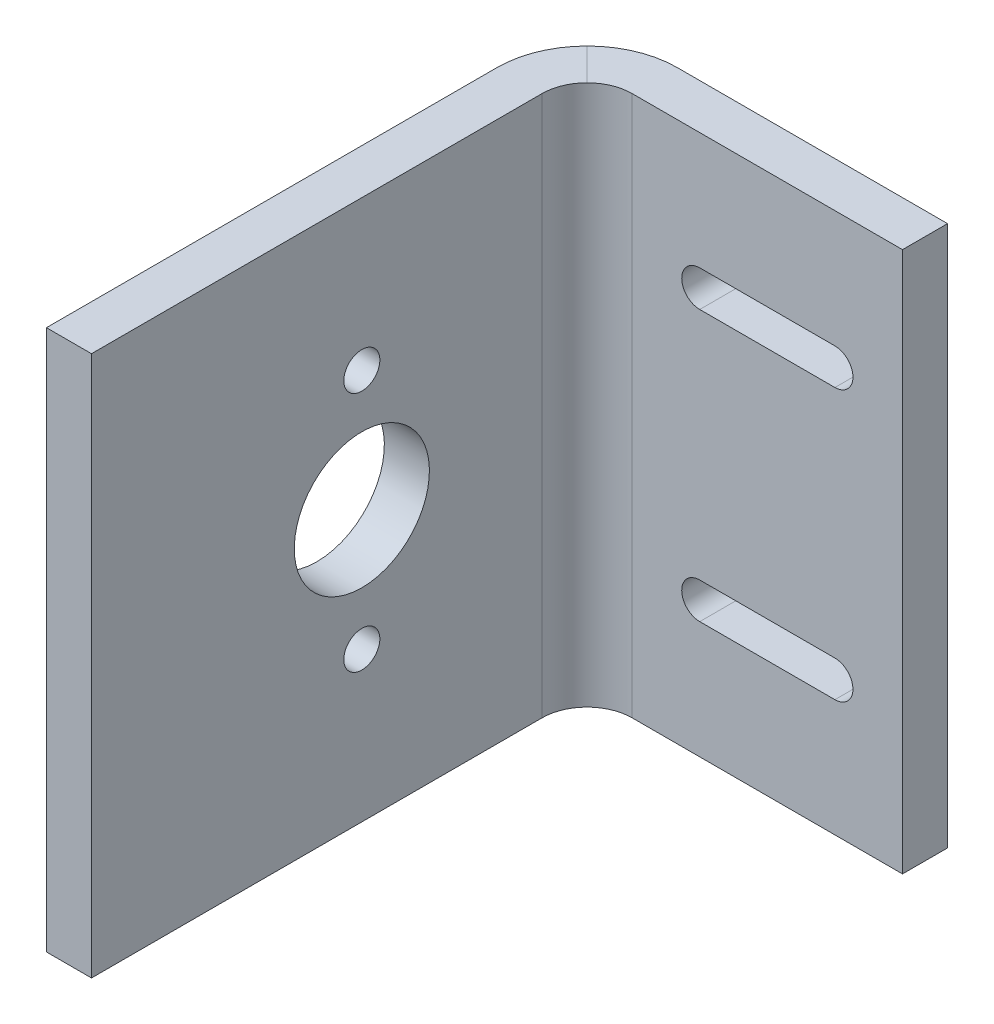
ISO-10303-21;
HEADER;
FILE_DESCRIPTION(('STEP AP214'),'2;1');
FILE_NAME('part.step','',(''),(''),'','','');
FILE_SCHEMA(('AUTOMOTIVE_DESIGN { 1 0 10303 214 1 1 1 1 }'));
ENDSEC;
DATA;
#1=APPLICATION_CONTEXT('core data for automotive mechanical design processes');
#2=APPLICATION_PROTOCOL_DEFINITION('international standard','automotive_design',2000,#1);
#3=PRODUCT_CONTEXT('',#1,'mechanical');
#4=PRODUCT('Part','Part','',(#3));
#5=PRODUCT_RELATED_PRODUCT_CATEGORY('part','',(#4));
#6=PRODUCT_DEFINITION_FORMATION('','',#4);
#7=PRODUCT_DEFINITION_CONTEXT('part definition',#1,'design');
#8=PRODUCT_DEFINITION('design','',#6,#7);
#9=PRODUCT_DEFINITION_SHAPE('','',#8);
#10=(LENGTH_UNIT() NAMED_UNIT(*) SI_UNIT(.MILLI.,.METRE.));
#11=(NAMED_UNIT(*) PLANE_ANGLE_UNIT() SI_UNIT($,.RADIAN.));
#12=(NAMED_UNIT(*) SI_UNIT($,.STERADIAN.) SOLID_ANGLE_UNIT());
#13=UNCERTAINTY_MEASURE_WITH_UNIT(LENGTH_MEASURE(1.E-05),#10,'distance_accuracy_value','');
#14=(GEOMETRIC_REPRESENTATION_CONTEXT(3) GLOBAL_UNCERTAINTY_ASSIGNED_CONTEXT((#13)) GLOBAL_UNIT_ASSIGNED_CONTEXT((#10,
#11,#12)) REPRESENTATION_CONTEXT('',''));
#15=CARTESIAN_POINT('',(0.,0.,0.));
#16=DIRECTION('',(0.,0.,1.));
#17=DIRECTION('',(1.,0.,0.));
#18=AXIS2_PLACEMENT_3D('',#15,#16,#17);
#19=CARTESIAN_POINT('',(25.4,0.,-38.1));
#20=DIRECTION('',(-1.,0.,0.));
#21=DIRECTION('',(0.,0.,1.));
#22=AXIS2_PLACEMENT_3D('',#19,#20,#21);
#23=PLANE('',#22);
#24=DIRECTION('',(0.,1.,0.));
#25=VECTOR('',#24,1.);
#26=CARTESIAN_POINT('',(25.4,-19.05,-34.925));
#27=LINE('',#26,#25);
#28=CARTESIAN_POINT('',(25.4,-19.05,-34.925));
#29=VERTEX_POINT('',#28);
#30=CARTESIAN_POINT('',(25.4,19.05,-34.925));
#31=VERTEX_POINT('',#30);
#32=EDGE_CURVE('E284',#29,#31,#27,.T.);
#33=ORIENTED_EDGE('',*,*,#32,.F.);
#34=DIRECTION('',(0.,0.,1.));
#35=VECTOR('',#34,1.);
#36=CARTESIAN_POINT('',(25.4,-19.05,-34.925));
#37=LINE('',#36,#35);
#38=CARTESIAN_POINT('',(25.4,-19.05,-38.1));
#39=VERTEX_POINT('',#38);
#40=EDGE_CURVE('E270',#39,#29,#37,.T.);
#41=ORIENTED_EDGE('',*,*,#40,.F.);
#42=DIRECTION('',(0.,-1.,0.));
#43=VECTOR('',#42,1.);
#44=CARTESIAN_POINT('',(25.4,-19.05,-38.1));
#45=LINE('',#44,#43);
#46=CARTESIAN_POINT('',(25.4,19.05,-38.1));
#47=VERTEX_POINT('',#46);
#48=EDGE_CURVE('E275',#47,#39,#45,.T.);
#49=ORIENTED_EDGE('',*,*,#48,.F.);
#50=DIRECTION('',(0.,0.,-1.));
#51=VECTOR('',#50,1.);
#52=CARTESIAN_POINT('',(25.4,19.05,-34.925));
#53=LINE('',#52,#51);
#54=EDGE_CURVE('E280',#31,#47,#53,.T.);
#55=ORIENTED_EDGE('',*,*,#54,.F.);
#56=EDGE_LOOP('',(#33,#41,#49,#55));
#57=FACE_BOUND('',#56,.T.);
#58=ADVANCED_FACE('F33',(#57),#23,.F.);
#59=CARTESIAN_POINT('',(0.,0.,0.));
#60=DIRECTION('',(0.,0.,1.));
#61=DIRECTION('',(1.,0.,0.));
#62=AXIS2_PLACEMENT_3D('',#59,#60,#61);
#63=PLANE('',#62);
#64=DIRECTION('',(0.,1.,0.));
#65=VECTOR('',#64,1.);
#66=CARTESIAN_POINT('',(3.175,-19.05,0.));
#67=LINE('',#66,#65);
#68=CARTESIAN_POINT('',(3.175,-19.05,0.));
#69=VERTEX_POINT('',#68);
#70=CARTESIAN_POINT('',(3.17499999999999,19.05,0.));
#71=VERTEX_POINT('',#70);
#72=EDGE_CURVE('E257',#69,#71,#67,.T.);
#73=ORIENTED_EDGE('',*,*,#72,.T.);
#74=DIRECTION('',(-1.,0.,0.));
#75=VECTOR('',#74,1.);
#76=CARTESIAN_POINT('',(3.17499999999999,19.05,0.));
#77=LINE('',#76,#75);
#78=CARTESIAN_POINT('',(0.,19.05,0.));
#79=VERTEX_POINT('',#78);
#80=EDGE_CURVE('E251',#71,#79,#77,.T.);
#81=ORIENTED_EDGE('',*,*,#80,.T.);
#82=DIRECTION('',(0.,-1.,0.));
#83=VECTOR('',#82,1.);
#84=CARTESIAN_POINT('',(0.,-19.05,0.));
#85=LINE('',#84,#83);
#86=CARTESIAN_POINT('',(0.,-19.05,0.));
#87=VERTEX_POINT('',#86);
#88=EDGE_CURVE('E242',#79,#87,#85,.T.);
#89=ORIENTED_EDGE('',*,*,#88,.T.);
#90=DIRECTION('',(1.,0.,0.));
#91=VECTOR('',#90,1.);
#92=CARTESIAN_POINT('',(3.175,-19.05,0.));
#93=LINE('',#92,#91);
#94=EDGE_CURVE('E239',#87,#69,#93,.T.);
#95=ORIENTED_EDGE('',*,*,#94,.T.);
#96=EDGE_LOOP('',(#73,#81,#89,#95));
#97=FACE_BOUND('',#96,.T.);
#98=ADVANCED_FACE('F361',(#97),#63,.T.);
#99=CARTESIAN_POINT('',(0.,-19.05,-34.925));
#100=DIRECTION('',(0.,0.,-1.));
#101=DIRECTION('',(0.,1.,0.));
#102=AXIS2_PLACEMENT_3D('',#99,#100,#101);
#103=PLANE('',#102);
#104=DIRECTION('',(1.,0.,0.));
#105=VECTOR('',#104,1.);
#106=CARTESIAN_POINT('',(0.,-8.25500000000001,-34.925));
#107=LINE('',#106,#105);
#108=CARTESIAN_POINT('',(11.1125,-8.25500000000001,-34.925));
#109=VERTEX_POINT('',#108);
#110=CARTESIAN_POINT('',(20.6375,-8.25500000000001,-34.925));
#111=VERTEX_POINT('',#110);
#112=EDGE_CURVE('E223',#109,#111,#107,.T.);
#113=ORIENTED_EDGE('',*,*,#112,.T.);
#114=CARTESIAN_POINT('',(20.6375,-9.52500000000001,-34.925));
#115=DIRECTION('',(0.,0.,-1.));
#116=DIRECTION('',(0.,1.,0.));
#117=AXIS2_PLACEMENT_3D('',#114,#115,#116);
#118=CIRCLE('',#117,1.27);
#119=CARTESIAN_POINT('',(20.6375,-10.795,-34.925));
#120=VERTEX_POINT('',#119);
#121=EDGE_CURVE('E226',#111,#120,#118,.T.);
#122=ORIENTED_EDGE('',*,*,#121,.T.);
#123=DIRECTION('',(-1.,0.,0.));
#124=VECTOR('',#123,1.);
#125=CARTESIAN_POINT('',(0.,-10.795,-34.925));
#126=LINE('',#125,#124);
#127=CARTESIAN_POINT('',(11.1125,-10.795,-34.925));
#128=VERTEX_POINT('',#127);
#129=EDGE_CURVE('E220',#120,#128,#126,.T.);
#130=ORIENTED_EDGE('',*,*,#129,.T.);
#131=CARTESIAN_POINT('',(11.1125,-9.52500000000001,-34.925));
#132=DIRECTION('',(0.,0.,-1.));
#133=DIRECTION('',(0.,1.,0.));
#134=AXIS2_PLACEMENT_3D('',#131,#132,#133);
#135=CIRCLE('',#134,1.27);
#136=EDGE_CURVE('E164',#128,#109,#135,.T.);
#137=ORIENTED_EDGE('',*,*,#136,.T.);
#138=EDGE_LOOP('',(#113,#122,#130,#137));
#139=FACE_BOUND('',#138,.T.);
#140=DIRECTION('',(1.,0.,0.));
#141=VECTOR('',#140,1.);
#142=CARTESIAN_POINT('',(0.,10.795,-34.925));
#143=LINE('',#142,#141);
#144=CARTESIAN_POINT('',(11.1125,10.795,-34.925));
#145=VERTEX_POINT('',#144);
#146=CARTESIAN_POINT('',(20.6375,10.795,-34.925));
#147=VERTEX_POINT('',#146);
#148=EDGE_CURVE('E214',#145,#147,#143,.T.);
#149=ORIENTED_EDGE('',*,*,#148,.T.);
#150=CARTESIAN_POINT('',(20.6375,9.52500000000002,-34.925));
#151=DIRECTION('',(0.,0.,-1.));
#152=DIRECTION('',(0.,1.,0.));
#153=AXIS2_PLACEMENT_3D('',#150,#151,#152);
#154=CIRCLE('',#153,1.27);
#155=CARTESIAN_POINT('',(20.6375,8.25500000000002,-34.925));
#156=VERTEX_POINT('',#155);
#157=EDGE_CURVE('E217',#147,#156,#154,.T.);
#158=ORIENTED_EDGE('',*,*,#157,.T.);
#159=DIRECTION('',(-1.,0.,0.));
#160=VECTOR('',#159,1.);
#161=CARTESIAN_POINT('',(0.,8.25500000000002,-34.925));
#162=LINE('',#161,#160);
#163=CARTESIAN_POINT('',(11.1125,8.25500000000002,-34.925));
#164=VERTEX_POINT('',#163);
#165=EDGE_CURVE('E188',#156,#164,#162,.T.);
#166=ORIENTED_EDGE('',*,*,#165,.T.);
#167=CARTESIAN_POINT('',(11.1125,9.52500000000002,-34.925));
#168=DIRECTION('',(0.,0.,-1.));
#169=DIRECTION('',(0.,1.,0.));
#170=AXIS2_PLACEMENT_3D('',#167,#168,#169);
#171=CIRCLE('',#170,1.27);
#172=EDGE_CURVE('E211',#164,#145,#171,.T.);
#173=ORIENTED_EDGE('',*,*,#172,.T.);
#174=EDGE_LOOP('',(#149,#158,#166,#173));
#175=FACE_BOUND('',#174,.T.);
#176=DIRECTION('',(1.,0.,0.));
#177=VECTOR('',#176,1.);
#178=CARTESIAN_POINT('',(0.,19.05,-34.925));
#179=LINE('',#178,#177);
#180=CARTESIAN_POINT('',(6.35,19.05,-34.925));
#181=VERTEX_POINT('',#180);
#182=EDGE_CURVE('E283',#181,#31,#179,.T.);
#183=ORIENTED_EDGE('',*,*,#182,.F.);
#184=DIRECTION('',(0.,-1.,0.));
#185=VECTOR('',#184,1.);
#186=CARTESIAN_POINT('',(6.35,-19.05,-34.925));
#187=LINE('',#186,#185);
#188=CARTESIAN_POINT('',(6.35,-19.05,-34.925));
#189=VERTEX_POINT('',#188);
#190=EDGE_CURVE('E260',#181,#189,#187,.T.);
#191=ORIENTED_EDGE('',*,*,#190,.T.);
#192=DIRECTION('',(1.,0.,0.));
#193=VECTOR('',#192,1.);
#194=CARTESIAN_POINT('',(0.,-19.05,-34.925));
#195=LINE('',#194,#193);
#196=EDGE_CURVE('E265',#189,#29,#195,.T.);
#197=ORIENTED_EDGE('',*,*,#196,.T.);
#198=ORIENTED_EDGE('',*,*,#32,.T.);
#199=EDGE_LOOP('',(#183,#191,#197,#198));
#200=FACE_BOUND('',#199,.T.);
#201=ADVANCED_FACE('F358',(#139,#175,#200),#103,.F.);
#202=CARTESIAN_POINT('',(0.,19.05,-34.925));
#203=DIRECTION('',(0.,-1.,0.));
#204=DIRECTION('',(0.,0.,-1.));
#205=AXIS2_PLACEMENT_3D('',#202,#203,#204);
#206=PLANE('',#205);
#207=DIRECTION('',(1.,0.,0.));
#208=VECTOR('',#207,1.);
#209=CARTESIAN_POINT('',(0.,19.05,-38.1));
#210=LINE('',#209,#208);
#211=CARTESIAN_POINT('',(6.34999999999999,19.05,-38.1));
#212=VERTEX_POINT('',#211);
#213=EDGE_CURVE('E278',#212,#47,#210,.T.);
#214=ORIENTED_EDGE('',*,*,#213,.F.);
#215=CARTESIAN_POINT('',(6.34999999999999,19.05,-31.75));
#216=DIRECTION('',(0.,-1.,0.));
#217=DIRECTION('',(0.,0.,-1.));
#218=AXIS2_PLACEMENT_3D('',#215,#216,#217);
#219=CIRCLE('',#218,6.35);
#220=CARTESIAN_POINT('',(1.85987193946542,19.05,-36.2401280605346));
#221=VERTEX_POINT('',#220);
#222=EDGE_CURVE('E42',#212,#221,#219,.F.);
#223=ORIENTED_EDGE('',*,*,#222,.T.);
#224=DIRECTION('',(0.707106781186548,0.,0.707106781186548));
#225=VECTOR('',#224,1.);
#226=CARTESIAN_POINT('',(20.6375,19.05,-17.4625));
#227=LINE('',#226,#225);
#228=CARTESIAN_POINT('',(4.10493596973271,19.05,-33.9950640302673));
#229=VERTEX_POINT('',#228);
#230=EDGE_CURVE('E248',#221,#229,#227,.T.);
#231=ORIENTED_EDGE('',*,*,#230,.T.);
#232=CARTESIAN_POINT('',(6.35,19.05,-31.75));
#233=DIRECTION('',(0.,-1.,0.));
#234=DIRECTION('',(0.,0.,-1.));
#235=AXIS2_PLACEMENT_3D('',#232,#233,#234);
#236=CIRCLE('',#235,3.175);
#237=EDGE_CURVE('E301',#229,#181,#236,.T.);
#238=ORIENTED_EDGE('',*,*,#237,.T.);
#239=ORIENTED_EDGE('',*,*,#182,.T.);
#240=ORIENTED_EDGE('',*,*,#54,.T.);
#241=EDGE_LOOP('',(#214,#223,#231,#238,#239,#240));
#242=FACE_BOUND('',#241,.T.);
#243=ADVANCED_FACE('F357',(#242),#206,.F.);
#244=CARTESIAN_POINT('',(0.,-19.05,-38.1));
#245=DIRECTION('',(0.,0.,1.));
#246=DIRECTION('',(0.,-1.,0.));
#247=AXIS2_PLACEMENT_3D('',#244,#245,#246);
#248=PLANE('',#247);
#249=DIRECTION('',(-1.,0.,0.));
#250=VECTOR('',#249,1.);
#251=CARTESIAN_POINT('',(20.6375,-10.795,-38.1));
#252=LINE('',#251,#250);
#253=CARTESIAN_POINT('',(20.6375,-10.795,-38.1));
#254=VERTEX_POINT('',#253);
#255=CARTESIAN_POINT('',(11.1125,-10.795,-38.1));
#256=VERTEX_POINT('',#255);
#257=EDGE_CURVE('E171',#254,#256,#252,.T.);
#258=ORIENTED_EDGE('',*,*,#257,.F.);
#259=CARTESIAN_POINT('',(20.6375,-9.52500000000001,-38.1));
#260=DIRECTION('',(0.,0.,-1.));
#261=DIRECTION('',(0.,1.,0.));
#262=AXIS2_PLACEMENT_3D('',#259,#260,#261);
#263=CIRCLE('',#262,1.27);
#264=CARTESIAN_POINT('',(20.6375,-8.25500000000001,-38.1));
#265=VERTEX_POINT('',#264);
#266=EDGE_CURVE('E176',#265,#254,#263,.T.);
#267=ORIENTED_EDGE('',*,*,#266,.F.);
#268=DIRECTION('',(1.,0.,0.));
#269=VECTOR('',#268,1.);
#270=CARTESIAN_POINT('',(20.6375,-8.25500000000001,-38.1));
#271=LINE('',#270,#269);
#272=CARTESIAN_POINT('',(11.1125,-8.25500000000001,-38.1));
#273=VERTEX_POINT('',#272);
#274=EDGE_CURVE('E181',#273,#265,#271,.T.);
#275=ORIENTED_EDGE('',*,*,#274,.F.);
#276=CARTESIAN_POINT('',(11.1125,-9.52500000000001,-38.1));
#277=DIRECTION('',(0.,0.,-1.));
#278=DIRECTION('',(0.,1.,0.));
#279=AXIS2_PLACEMENT_3D('',#276,#277,#278);
#280=CIRCLE('',#279,1.27);
#281=EDGE_CURVE('E161',#256,#273,#280,.T.);
#282=ORIENTED_EDGE('',*,*,#281,.F.);
#283=EDGE_LOOP('',(#258,#267,#275,#282));
#284=FACE_BOUND('',#283,.T.);
#285=DIRECTION('',(-1.,0.,0.));
#286=VECTOR('',#285,1.);
#287=CARTESIAN_POINT('',(20.6375,8.25500000000002,-38.1));
#288=LINE('',#287,#286);
#289=CARTESIAN_POINT('',(20.6375,8.25500000000002,-38.1));
#290=VERTEX_POINT('',#289);
#291=CARTESIAN_POINT('',(11.1125,8.25500000000002,-38.1));
#292=VERTEX_POINT('',#291);
#293=EDGE_CURVE('E193',#290,#292,#288,.T.);
#294=ORIENTED_EDGE('',*,*,#293,.F.);
#295=CARTESIAN_POINT('',(20.6375,9.52500000000002,-38.1));
#296=DIRECTION('',(0.,0.,-1.));
#297=DIRECTION('',(0.,-1.,0.));
#298=AXIS2_PLACEMENT_3D('',#295,#296,#297);
#299=CIRCLE('',#298,1.27);
#300=CARTESIAN_POINT('',(20.6375,10.795,-38.1));
#301=VERTEX_POINT('',#300);
#302=EDGE_CURVE('E191',#301,#290,#299,.T.);
#303=ORIENTED_EDGE('',*,*,#302,.F.);
#304=DIRECTION('',(1.,0.,0.));
#305=VECTOR('',#304,1.);
#306=CARTESIAN_POINT('',(20.6375,10.795,-38.1));
#307=LINE('',#306,#305);
#308=CARTESIAN_POINT('',(11.1125,10.795,-38.1));
#309=VERTEX_POINT('',#308);
#310=EDGE_CURVE('E198',#309,#301,#307,.T.);
#311=ORIENTED_EDGE('',*,*,#310,.F.);
#312=CARTESIAN_POINT('',(11.1125,9.52500000000002,-38.1));
#313=DIRECTION('',(0.,0.,-1.));
#314=DIRECTION('',(0.,-1.,0.));
#315=AXIS2_PLACEMENT_3D('',#312,#313,#314);
#316=CIRCLE('',#315,1.27);
#317=EDGE_CURVE('E195',#292,#309,#316,.T.);
#318=ORIENTED_EDGE('',*,*,#317,.F.);
#319=EDGE_LOOP('',(#294,#303,#311,#318));
#320=FACE_BOUND('',#319,.T.);
#321=DIRECTION('',(1.,0.,0.));
#322=VECTOR('',#321,1.);
#323=CARTESIAN_POINT('',(0.,-19.05,-38.1));
#324=LINE('',#323,#322);
#325=CARTESIAN_POINT('',(6.35,-19.05,-38.1));
#326=VERTEX_POINT('',#325);
#327=EDGE_CURVE('E273',#326,#39,#324,.T.);
#328=ORIENTED_EDGE('',*,*,#327,.F.);
#329=DIRECTION('',(0.,-1.,0.));
#330=VECTOR('',#329,1.);
#331=CARTESIAN_POINT('',(6.35,-19.05,-38.1));
#332=LINE('',#331,#330);
#333=EDGE_CURVE('E310',#326,#212,#332,.F.);
#334=ORIENTED_EDGE('',*,*,#333,.T.);
#335=ORIENTED_EDGE('',*,*,#213,.T.);
#336=ORIENTED_EDGE('',*,*,#48,.T.);
#337=EDGE_LOOP('',(#328,#334,#335,#336));
#338=FACE_BOUND('',#337,.T.);
#339=ADVANCED_FACE('F178',(#284,#320,#338),#248,.F.);
#340=CARTESIAN_POINT('',(0.,-19.05,-34.925));
#341=DIRECTION('',(0.,1.,0.));
#342=DIRECTION('',(0.,0.,1.));
#343=AXIS2_PLACEMENT_3D('',#340,#341,#342);
#344=PLANE('',#343);
#345=DIRECTION('',(-0.707106781186548,0.,-0.707106781186548));
#346=VECTOR('',#345,1.);
#347=CARTESIAN_POINT('',(20.6375,-19.05,-17.4625));
#348=LINE('',#347,#346);
#349=CARTESIAN_POINT('',(4.10493596973271,-19.05,-33.9950640302673));
#350=VERTEX_POINT('',#349);
#351=CARTESIAN_POINT('',(1.85987193946542,-19.05,-36.2401280605346));
#352=VERTEX_POINT('',#351);
#353=EDGE_CURVE('E262',#350,#352,#348,.T.);
#354=ORIENTED_EDGE('',*,*,#353,.T.);
#355=CARTESIAN_POINT('',(6.35,-19.05,-31.75));
#356=DIRECTION('',(0.,1.,0.));
#357=DIRECTION('',(0.,0.,1.));
#358=AXIS2_PLACEMENT_3D('',#355,#356,#357);
#359=CIRCLE('',#358,6.35);
#360=EDGE_CURVE('E308',#352,#326,#359,.F.);
#361=ORIENTED_EDGE('',*,*,#360,.T.);
#362=ORIENTED_EDGE('',*,*,#327,.T.);
#363=ORIENTED_EDGE('',*,*,#40,.T.);
#364=ORIENTED_EDGE('',*,*,#196,.F.);
#365=CARTESIAN_POINT('',(6.35,-19.05,-31.75));
#366=DIRECTION('',(0.,1.,0.));
#367=DIRECTION('',(0.,0.,1.));
#368=AXIS2_PLACEMENT_3D('',#365,#366,#367);
#369=CIRCLE('',#368,3.175);
#370=EDGE_CURVE('E293',#189,#350,#369,.T.);
#371=ORIENTED_EDGE('',*,*,#370,.T.);
#372=EDGE_LOOP('',(#354,#361,#362,#363,#364,#371));
#373=FACE_BOUND('',#372,.T.);
#374=ADVANCED_FACE('F356',(#373),#344,.F.);
#375=CARTESIAN_POINT('',(0.,-19.05,0.));
#376=DIRECTION('',(1.,0.,0.));
#377=DIRECTION('',(0.,1.,0.));
#378=AXIS2_PLACEMENT_3D('',#375,#376,#377);
#379=PLANE('',#378);
#380=CARTESIAN_POINT('',(0.,8.509,-19.05));
#381=DIRECTION('',(-1.,0.,0.));
#382=DIRECTION('',(0.,-1.,0.));
#383=AXIS2_PLACEMENT_3D('',#380,#381,#382);
#384=CIRCLE('',#383,1.27);
#385=CARTESIAN_POINT('',(0.,7.239,-19.05));
#386=VERTEX_POINT('',#385);
#387=EDGE_CURVE('E230',#386,#386,#384,.T.);
#388=ORIENTED_EDGE('',*,*,#387,.F.);
#389=EDGE_LOOP('',(#388));
#390=FACE_BOUND('',#389,.T.);
#391=CARTESIAN_POINT('',(0.,-8.509,-19.05));
#392=DIRECTION('',(-1.,0.,0.));
#393=DIRECTION('',(0.,1.,0.));
#394=AXIS2_PLACEMENT_3D('',#391,#392,#393);
#395=CIRCLE('',#394,1.27);
#396=CARTESIAN_POINT('',(0.,-9.779,-19.05));
#397=VERTEX_POINT('',#396);
#398=EDGE_CURVE('E234',#397,#397,#395,.T.);
#399=ORIENTED_EDGE('',*,*,#398,.F.);
#400=EDGE_LOOP('',(#399));
#401=FACE_BOUND('',#400,.T.);
#402=CARTESIAN_POINT('',(0.,0.,-19.05));
#403=DIRECTION('',(-1.,0.,0.));
#404=DIRECTION('',(0.,-1.,0.));
#405=AXIS2_PLACEMENT_3D('',#402,#403,#404);
#406=CIRCLE('',#405,4.7625);
#407=CARTESIAN_POINT('',(0.,-4.7625,-19.05));
#408=VERTEX_POINT('',#407);
#409=EDGE_CURVE('E229',#408,#408,#406,.T.);
#410=ORIENTED_EDGE('',*,*,#409,.F.);
#411=EDGE_LOOP('',(#410));
#412=FACE_BOUND('',#411,.T.);
#413=DIRECTION('',(0.,0.,-1.));
#414=VECTOR('',#413,1.);
#415=CARTESIAN_POINT('',(0.,19.05,0.));
#416=LINE('',#415,#414);
#417=CARTESIAN_POINT('',(0.,19.05,-31.75));
#418=VERTEX_POINT('',#417);
#419=EDGE_CURVE('E247',#79,#418,#416,.T.);
#420=ORIENTED_EDGE('',*,*,#419,.T.);
#421=DIRECTION('',(0.,-1.,0.));
#422=VECTOR('',#421,1.);
#423=CARTESIAN_POINT('',(0.,-19.05,-31.75));
#424=LINE('',#423,#422);
#425=CARTESIAN_POINT('',(0.,-19.05,-31.75));
#426=VERTEX_POINT('',#425);
#427=EDGE_CURVE('E303',#418,#426,#424,.T.);
#428=ORIENTED_EDGE('',*,*,#427,.T.);
#429=DIRECTION('',(0.,0.,-1.));
#430=VECTOR('',#429,1.);
#431=CARTESIAN_POINT('',(0.,-19.05,0.));
#432=LINE('',#431,#430);
#433=EDGE_CURVE('E244',#87,#426,#432,.T.);
#434=ORIENTED_EDGE('',*,*,#433,.F.);
#435=ORIENTED_EDGE('',*,*,#88,.F.);
#436=EDGE_LOOP('',(#420,#428,#434,#435));
#437=FACE_BOUND('',#436,.T.);
#438=ADVANCED_FACE('F368',(#390,#401,#412,#437),#379,.F.);
#439=CARTESIAN_POINT('',(3.175,-19.05,0.));
#440=DIRECTION('',(-1.,0.,0.));
#441=DIRECTION('',(0.,-1.,0.));
#442=AXIS2_PLACEMENT_3D('',#439,#440,#441);
#443=PLANE('',#442);
#444=CARTESIAN_POINT('',(3.175,8.509,-19.05));
#445=DIRECTION('',(-1.,0.,0.));
#446=DIRECTION('',(0.,-1.,0.));
#447=AXIS2_PLACEMENT_3D('',#444,#445,#446);
#448=CIRCLE('',#447,1.27);
#449=CARTESIAN_POINT('',(3.175,7.239,-19.05));
#450=VERTEX_POINT('',#449);
#451=EDGE_CURVE('E37',#450,#450,#448,.T.);
#452=ORIENTED_EDGE('',*,*,#451,.T.);
#453=EDGE_LOOP('',(#452));
#454=FACE_BOUND('',#453,.T.);
#455=CARTESIAN_POINT('',(3.175,-8.509,-19.05));
#456=DIRECTION('',(-1.,0.,0.));
#457=DIRECTION('',(0.,-1.,0.));
#458=AXIS2_PLACEMENT_3D('',#455,#456,#457);
#459=CIRCLE('',#458,1.27);
#460=CARTESIAN_POINT('',(3.175,-9.779,-19.05));
#461=VERTEX_POINT('',#460);
#462=EDGE_CURVE('E314',#461,#461,#459,.T.);
#463=ORIENTED_EDGE('',*,*,#462,.T.);
#464=EDGE_LOOP('',(#463));
#465=FACE_BOUND('',#464,.T.);
#466=CARTESIAN_POINT('',(3.175,0.,-19.05));
#467=DIRECTION('',(-1.,0.,0.));
#468=DIRECTION('',(0.,-1.,0.));
#469=AXIS2_PLACEMENT_3D('',#466,#467,#468);
#470=CIRCLE('',#469,4.7625);
#471=CARTESIAN_POINT('',(3.175,-4.7625,-19.05));
#472=VERTEX_POINT('',#471);
#473=EDGE_CURVE('E233',#472,#472,#470,.T.);
#474=ORIENTED_EDGE('',*,*,#473,.T.);
#475=EDGE_LOOP('',(#474));
#476=FACE_BOUND('',#475,.T.);
#477=DIRECTION('',(0.,0.,-1.));
#478=VECTOR('',#477,1.);
#479=CARTESIAN_POINT('',(3.175,-19.05,0.));
#480=LINE('',#479,#478);
#481=CARTESIAN_POINT('',(3.175,-19.05,-31.75));
#482=VERTEX_POINT('',#481);
#483=EDGE_CURVE('E243',#69,#482,#480,.T.);
#484=ORIENTED_EDGE('',*,*,#483,.T.);
#485=DIRECTION('',(0.,-1.,0.));
#486=VECTOR('',#485,1.);
#487=CARTESIAN_POINT('',(3.17499999999999,19.05,-31.75));
#488=LINE('',#487,#486);
#489=CARTESIAN_POINT('',(3.17499999999999,19.05,-31.75));
#490=VERTEX_POINT('',#489);
#491=EDGE_CURVE('E291',#482,#490,#488,.F.);
#492=ORIENTED_EDGE('',*,*,#491,.T.);
#493=DIRECTION('',(0.,0.,-1.));
#494=VECTOR('',#493,1.);
#495=CARTESIAN_POINT('',(3.17499999999999,19.05,0.));
#496=LINE('',#495,#494);
#497=EDGE_CURVE('E254',#71,#490,#496,.T.);
#498=ORIENTED_EDGE('',*,*,#497,.F.);
#499=ORIENTED_EDGE('',*,*,#72,.F.);
#500=EDGE_LOOP('',(#484,#492,#498,#499));
#501=FACE_BOUND('',#500,.T.);
#502=ADVANCED_FACE('F321',(#454,#465,#476,#501),#443,.F.);
#503=CARTESIAN_POINT('',(3.17499999999999,19.05,0.));
#504=DIRECTION('',(0.,-1.,0.));
#505=DIRECTION('',(0.,0.,-1.));
#506=AXIS2_PLACEMENT_3D('',#503,#504,#505);
#507=PLANE('',#506);
#508=ORIENTED_EDGE('',*,*,#230,.F.);
#509=CARTESIAN_POINT('',(6.34999999999999,19.05,-31.75));
#510=DIRECTION('',(0.,-1.,0.));
#511=DIRECTION('',(0.,0.,-1.));
#512=AXIS2_PLACEMENT_3D('',#509,#510,#511);
#513=CIRCLE('',#512,6.35);
#514=EDGE_CURVE('E11',#221,#418,#513,.F.);
#515=ORIENTED_EDGE('',*,*,#514,.T.);
#516=ORIENTED_EDGE('',*,*,#419,.F.);
#517=ORIENTED_EDGE('',*,*,#80,.F.);
#518=ORIENTED_EDGE('',*,*,#497,.T.);
#519=CARTESIAN_POINT('',(6.35,19.05,-31.75));
#520=DIRECTION('',(0.,-1.,0.));
#521=DIRECTION('',(0.,0.,-1.));
#522=AXIS2_PLACEMENT_3D('',#519,#520,#521);
#523=CIRCLE('',#522,3.175);
#524=EDGE_CURVE('E298',#490,#229,#523,.T.);
#525=ORIENTED_EDGE('',*,*,#524,.T.);
#526=EDGE_LOOP('',(#508,#515,#516,#517,#518,#525));
#527=FACE_BOUND('',#526,.T.);
#528=ADVANCED_FACE('F342',(#527),#507,.F.);
#529=CARTESIAN_POINT('',(3.175,-19.05,0.));
#530=DIRECTION('',(0.,1.,0.));
#531=DIRECTION('',(0.,0.,1.));
#532=AXIS2_PLACEMENT_3D('',#529,#530,#531);
#533=PLANE('',#532);
#534=ORIENTED_EDGE('',*,*,#433,.T.);
#535=CARTESIAN_POINT('',(6.35,-19.05,-31.75));
#536=DIRECTION('',(0.,1.,0.));
#537=DIRECTION('',(0.,0.,1.));
#538=AXIS2_PLACEMENT_3D('',#535,#536,#537);
#539=CIRCLE('',#538,6.35);
#540=EDGE_CURVE('E306',#426,#352,#539,.F.);
#541=ORIENTED_EDGE('',*,*,#540,.T.);
#542=ORIENTED_EDGE('',*,*,#353,.F.);
#543=CARTESIAN_POINT('',(6.35,-19.05,-31.75));
#544=DIRECTION('',(0.,1.,0.));
#545=DIRECTION('',(0.,0.,1.));
#546=AXIS2_PLACEMENT_3D('',#543,#544,#545);
#547=CIRCLE('',#546,3.175);
#548=EDGE_CURVE('E296',#350,#482,#547,.T.);
#549=ORIENTED_EDGE('',*,*,#548,.T.);
#550=ORIENTED_EDGE('',*,*,#483,.F.);
#551=ORIENTED_EDGE('',*,*,#94,.F.);
#552=EDGE_LOOP('',(#534,#541,#542,#549,#550,#551));
#553=FACE_BOUND('',#552,.T.);
#554=ADVANCED_FACE('F339',(#553),#533,.F.);
#555=CARTESIAN_POINT('',(6.35,-19.05,-31.75));
#556=DIRECTION('',(0.,1.,0.));
#557=DIRECTION('',(-1.,0.,0.));
#558=AXIS2_PLACEMENT_3D('',#555,#556,#557);
#559=CYLINDRICAL_SURFACE('',#558,3.175);
#560=ORIENTED_EDGE('',*,*,#524,.F.);
#561=ORIENTED_EDGE('',*,*,#491,.F.);
#562=ORIENTED_EDGE('',*,*,#548,.F.);
#563=ORIENTED_EDGE('',*,*,#370,.F.);
#564=ORIENTED_EDGE('',*,*,#190,.F.);
#565=ORIENTED_EDGE('',*,*,#237,.F.);
#566=EDGE_LOOP('',(#560,#561,#562,#563,#564,#565));
#567=FACE_BOUND('',#566,.T.);
#568=ADVANCED_FACE('F341',(#567),#559,.F.);
#569=CARTESIAN_POINT('',(6.35,-19.05,-31.75));
#570=DIRECTION('',(0.,-1.,0.));
#571=DIRECTION('',(0.,0.,-1.));
#572=AXIS2_PLACEMENT_3D('',#569,#570,#571);
#573=CYLINDRICAL_SURFACE('',#572,6.35);
#574=ORIENTED_EDGE('',*,*,#222,.F.);
#575=ORIENTED_EDGE('',*,*,#333,.F.);
#576=ORIENTED_EDGE('',*,*,#360,.F.);
#577=ORIENTED_EDGE('',*,*,#540,.F.);
#578=ORIENTED_EDGE('',*,*,#427,.F.);
#579=ORIENTED_EDGE('',*,*,#514,.F.);
#580=EDGE_LOOP('',(#574,#575,#576,#577,#578,#579));
#581=FACE_BOUND('',#580,.T.);
#582=ADVANCED_FACE('F35',(#581),#573,.T.);
#583=CARTESIAN_POINT('',(25.4,0.,-19.05));
#584=DIRECTION('',(-1.,0.,0.));
#585=DIRECTION('',(0.,-1.,0.));
#586=AXIS2_PLACEMENT_3D('',#583,#584,#585);
#587=CYLINDRICAL_SURFACE('',#586,4.7625);
#588=CARTESIAN_POINT('',(0.,-4.7625,-19.05));
#589=CARTESIAN_POINT('',(0.0330729166666671,-4.7625,-19.05));
#590=CARTESIAN_POINT('',(0.0661458333333342,-4.7625,-19.05));
#591=CARTESIAN_POINT('',(0.132291666666667,-4.7625,-19.05));
#592=CARTESIAN_POINT('',(0.165364583333333,-4.7625,-19.05));
#593=CARTESIAN_POINT('',(0.231510416666666,-4.7625,-19.05));
#594=CARTESIAN_POINT('',(0.264583333333333,-4.7625,-19.05));
#595=CARTESIAN_POINT('',(0.330729166666667,-4.7625,-19.05));
#596=CARTESIAN_POINT('',(0.363802083333334,-4.7625,-19.05));
#597=CARTESIAN_POINT('',(0.429947916666667,-4.7625,-19.05));
#598=CARTESIAN_POINT('',(0.463020833333333,-4.7625,-19.05));
#599=CARTESIAN_POINT('',(0.529166666666666,-4.7625,-19.05));
#600=CARTESIAN_POINT('',(0.562239583333333,-4.7625,-19.05));
#601=CARTESIAN_POINT('',(0.628385416666667,-4.7625,-19.05));
#602=CARTESIAN_POINT('',(0.661458333333334,-4.7625,-19.05));
#603=CARTESIAN_POINT('',(0.727604166666669,-4.7625,-19.05));
#604=CARTESIAN_POINT('',(0.760677083333336,-4.7625,-19.05));
#605=CARTESIAN_POINT('',(0.826822916666669,-4.7625,-19.05));
#606=CARTESIAN_POINT('',(0.859895833333335,-4.7625,-19.05));
#607=CARTESIAN_POINT('',(0.926041666666668,-4.7625,-19.05));
#608=CARTESIAN_POINT('',(0.959114583333335,-4.7625,-19.05));
#609=CARTESIAN_POINT('',(1.02526041666667,-4.7625,-19.05));
#610=CARTESIAN_POINT('',(1.05833333333334,-4.7625,-19.05));
#611=CARTESIAN_POINT('',(1.12447916666667,-4.7625,-19.05));
#612=CARTESIAN_POINT('',(1.15755208333333,-4.7625,-19.05));
#613=CARTESIAN_POINT('',(1.22369791666667,-4.7625,-19.05));
#614=CARTESIAN_POINT('',(1.25677083333333,-4.7625,-19.05));
#615=CARTESIAN_POINT('',(1.32291666666667,-4.7625,-19.05));
#616=CARTESIAN_POINT('',(1.35598958333334,-4.7625,-19.05));
#617=CARTESIAN_POINT('',(1.42213541666667,-4.7625,-19.05));
#618=CARTESIAN_POINT('',(1.45520833333333,-4.7625,-19.05));
#619=CARTESIAN_POINT('',(1.52135416666667,-4.7625,-19.05));
#620=CARTESIAN_POINT('',(1.55442708333333,-4.7625,-19.05));
#621=CARTESIAN_POINT('',(1.62057291666667,-4.7625,-19.05));
#622=CARTESIAN_POINT('',(1.65364583333334,-4.7625,-19.05));
#623=CARTESIAN_POINT('',(1.71979166666667,-4.7625,-19.05));
#624=CARTESIAN_POINT('',(1.75286458333334,-4.7625,-19.05));
#625=CARTESIAN_POINT('',(1.81901041666667,-4.7625,-19.05));
#626=CARTESIAN_POINT('',(1.85208333333334,-4.7625,-19.05));
#627=CARTESIAN_POINT('',(1.91822916666667,-4.7625,-19.05));
#628=CARTESIAN_POINT('',(1.95130208333334,-4.7625,-19.05));
#629=CARTESIAN_POINT('',(2.01744791666667,-4.7625,-19.05));
#630=CARTESIAN_POINT('',(2.05052083333334,-4.7625,-19.05));
#631=CARTESIAN_POINT('',(2.11666666666667,-4.7625,-19.05));
#632=CARTESIAN_POINT('',(2.14973958333334,-4.7625,-19.05));
#633=CARTESIAN_POINT('',(2.21588541666667,-4.7625,-19.05));
#634=CARTESIAN_POINT('',(2.24895833333334,-4.7625,-19.05));
#635=CARTESIAN_POINT('',(2.31510416666667,-4.7625,-19.05));
#636=CARTESIAN_POINT('',(2.34817708333334,-4.7625,-19.05));
#637=CARTESIAN_POINT('',(2.41432291666667,-4.7625,-19.05));
#638=CARTESIAN_POINT('',(2.44739583333334,-4.7625,-19.05));
#639=CARTESIAN_POINT('',(2.51354166666667,-4.7625,-19.05));
#640=CARTESIAN_POINT('',(2.54661458333334,-4.7625,-19.05));
#641=CARTESIAN_POINT('',(2.61276041666667,-4.7625,-19.05));
#642=CARTESIAN_POINT('',(2.64583333333334,-4.7625,-19.05));
#643=CARTESIAN_POINT('',(2.71197916666667,-4.7625,-19.05));
#644=CARTESIAN_POINT('',(2.74505208333334,-4.7625,-19.05));
#645=CARTESIAN_POINT('',(2.81119791666667,-4.7625,-19.05));
#646=CARTESIAN_POINT('',(2.84427083333334,-4.7625,-19.05));
#647=CARTESIAN_POINT('',(2.91041666666667,-4.7625,-19.05));
#648=CARTESIAN_POINT('',(2.94348958333334,-4.7625,-19.05));
#649=CARTESIAN_POINT('',(3.00963541666667,-4.7625,-19.05));
#650=CARTESIAN_POINT('',(3.04270833333334,-4.7625,-19.05));
#651=CARTESIAN_POINT('',(3.10885416666667,-4.7625,-19.05));
#652=CARTESIAN_POINT('',(3.14192708333334,-4.7625,-19.05));
#653=CARTESIAN_POINT('',(3.175,-4.7625,-19.05));
#654=B_SPLINE_CURVE_WITH_KNOTS('',3,(#588,#589,#590,#591,#592,#593,#594,#595,#596,#597,#598,
#599,#600,#601,#602,#603,#604,#605,#606,#607,#608,#609,#610,#611,#612,#613,#614,#615,#616,#617,
#618,#619,#620,#621,#622,#623,#624,#625,#626,#627,#628,#629,#630,#631,#632,#633,#634,#635,#636,
#637,#638,#639,#640,#641,#642,#643,#644,#645,#646,#647,#648,#649,#650,#651,#652,#653),
.UNSPECIFIED.,.F.,.F.,(4,2,2,2,2,2,2,2,2,2,2,2,2,2,2,2,2,2,2,2,2,2,2,2,2,2,2,2,2,2,2,2,4),(0.,
0.0992187500000012,0.198437499999999,0.29765625,0.396875000000001,0.496093749999999,0.5953125,
0.694531250000002,0.793750000000003,0.892968750000001,0.992187500000002,1.09140625,1.190625,
1.28984375,1.3890625,1.48828125,1.5875,1.68671875,1.7859375,1.88515625,1.984375,2.08359375,
2.1828125,2.28203125,2.38125,2.48046875,2.5796875,2.67890625,2.778125,2.87734375,
2.97656250000001,3.07578125,3.175),.UNSPECIFIED.);
#655=EDGE_CURVE('BSEAM336',#408,#472,#654,.T.);
#656=ORIENTED_EDGE('',*,*,#409,.T.);
#657=ORIENTED_EDGE('',*,*,#473,.F.);
#658=ORIENTED_EDGE('',*,*,#655,.T.);
#659=ORIENTED_EDGE('',*,*,#655,.F.);
#660=EDGE_LOOP('',(#656,#658,#657,#659));
#661=FACE_BOUND('',#660,.T.);
#662=ADVANCED_FACE('F336',(#661),#587,.F.);
#663=CARTESIAN_POINT('',(25.4,-8.50899999999999,-19.05));
#664=DIRECTION('',(-1.,0.,0.));
#665=DIRECTION('',(0.,-1.,0.));
#666=AXIS2_PLACEMENT_3D('',#663,#664,#665);
#667=CYLINDRICAL_SURFACE('',#666,1.27);
#668=CARTESIAN_POINT('',(0.,-9.779,-19.05));
#669=CARTESIAN_POINT('',(0.0330729166666671,-9.779,-19.05));
#670=CARTESIAN_POINT('',(0.0661458333333342,-9.779,-19.05));
#671=CARTESIAN_POINT('',(0.132291666666667,-9.779,-19.05));
#672=CARTESIAN_POINT('',(0.165364583333333,-9.779,-19.05));
#673=CARTESIAN_POINT('',(0.231510416666666,-9.779,-19.05));
#674=CARTESIAN_POINT('',(0.264583333333333,-9.779,-19.05));
#675=CARTESIAN_POINT('',(0.330729166666667,-9.779,-19.05));
#676=CARTESIAN_POINT('',(0.363802083333334,-9.779,-19.05));
#677=CARTESIAN_POINT('',(0.429947916666667,-9.779,-19.05));
#678=CARTESIAN_POINT('',(0.463020833333333,-9.779,-19.05));
#679=CARTESIAN_POINT('',(0.529166666666666,-9.779,-19.05));
#680=CARTESIAN_POINT('',(0.562239583333333,-9.779,-19.05));
#681=CARTESIAN_POINT('',(0.628385416666667,-9.779,-19.05));
#682=CARTESIAN_POINT('',(0.661458333333334,-9.779,-19.05));
#683=CARTESIAN_POINT('',(0.727604166666669,-9.779,-19.05));
#684=CARTESIAN_POINT('',(0.760677083333336,-9.779,-19.05));
#685=CARTESIAN_POINT('',(0.826822916666669,-9.779,-19.05));
#686=CARTESIAN_POINT('',(0.859895833333335,-9.779,-19.05));
#687=CARTESIAN_POINT('',(0.926041666666668,-9.779,-19.05));
#688=CARTESIAN_POINT('',(0.959114583333335,-9.779,-19.05));
#689=CARTESIAN_POINT('',(1.02526041666667,-9.779,-19.05));
#690=CARTESIAN_POINT('',(1.05833333333334,-9.779,-19.05));
#691=CARTESIAN_POINT('',(1.12447916666667,-9.779,-19.05));
#692=CARTESIAN_POINT('',(1.15755208333333,-9.779,-19.05));
#693=CARTESIAN_POINT('',(1.22369791666667,-9.779,-19.05));
#694=CARTESIAN_POINT('',(1.25677083333333,-9.779,-19.05));
#695=CARTESIAN_POINT('',(1.32291666666667,-9.779,-19.05));
#696=CARTESIAN_POINT('',(1.35598958333334,-9.779,-19.05));
#697=CARTESIAN_POINT('',(1.42213541666667,-9.779,-19.05));
#698=CARTESIAN_POINT('',(1.45520833333333,-9.779,-19.05));
#699=CARTESIAN_POINT('',(1.52135416666667,-9.779,-19.05));
#700=CARTESIAN_POINT('',(1.55442708333333,-9.779,-19.05));
#701=CARTESIAN_POINT('',(1.62057291666667,-9.779,-19.05));
#702=CARTESIAN_POINT('',(1.65364583333334,-9.779,-19.05));
#703=CARTESIAN_POINT('',(1.71979166666667,-9.779,-19.05));
#704=CARTESIAN_POINT('',(1.75286458333334,-9.779,-19.05));
#705=CARTESIAN_POINT('',(1.81901041666667,-9.779,-19.05));
#706=CARTESIAN_POINT('',(1.85208333333334,-9.779,-19.05));
#707=CARTESIAN_POINT('',(1.91822916666667,-9.779,-19.05));
#708=CARTESIAN_POINT('',(1.95130208333334,-9.779,-19.05));
#709=CARTESIAN_POINT('',(2.01744791666667,-9.779,-19.05));
#710=CARTESIAN_POINT('',(2.05052083333334,-9.779,-19.05));
#711=CARTESIAN_POINT('',(2.11666666666667,-9.779,-19.05));
#712=CARTESIAN_POINT('',(2.14973958333334,-9.779,-19.05));
#713=CARTESIAN_POINT('',(2.21588541666667,-9.779,-19.05));
#714=CARTESIAN_POINT('',(2.24895833333334,-9.779,-19.05));
#715=CARTESIAN_POINT('',(2.31510416666667,-9.779,-19.05));
#716=CARTESIAN_POINT('',(2.34817708333334,-9.779,-19.05));
#717=CARTESIAN_POINT('',(2.41432291666667,-9.779,-19.05));
#718=CARTESIAN_POINT('',(2.44739583333334,-9.779,-19.05));
#719=CARTESIAN_POINT('',(2.51354166666667,-9.779,-19.05));
#720=CARTESIAN_POINT('',(2.54661458333334,-9.779,-19.05));
#721=CARTESIAN_POINT('',(2.61276041666667,-9.779,-19.05));
#722=CARTESIAN_POINT('',(2.64583333333334,-9.779,-19.05));
#723=CARTESIAN_POINT('',(2.71197916666667,-9.779,-19.05));
#724=CARTESIAN_POINT('',(2.74505208333334,-9.779,-19.05));
#725=CARTESIAN_POINT('',(2.81119791666667,-9.779,-19.05));
#726=CARTESIAN_POINT('',(2.84427083333334,-9.779,-19.05));
#727=CARTESIAN_POINT('',(2.91041666666667,-9.779,-19.05));
#728=CARTESIAN_POINT('',(2.94348958333334,-9.779,-19.05));
#729=CARTESIAN_POINT('',(3.00963541666667,-9.779,-19.05));
#730=CARTESIAN_POINT('',(3.04270833333334,-9.779,-19.05));
#731=CARTESIAN_POINT('',(3.10885416666667,-9.779,-19.05));
#732=CARTESIAN_POINT('',(3.14192708333334,-9.779,-19.05));
#733=CARTESIAN_POINT('',(3.175,-9.779,-19.05));
#734=B_SPLINE_CURVE_WITH_KNOTS('',3,(#668,#669,#670,#671,#672,#673,#674,#675,#676,#677,#678,
#679,#680,#681,#682,#683,#684,#685,#686,#687,#688,#689,#690,#691,#692,#693,#694,#695,#696,#697,
#698,#699,#700,#701,#702,#703,#704,#705,#706,#707,#708,#709,#710,#711,#712,#713,#714,#715,#716,
#717,#718,#719,#720,#721,#722,#723,#724,#725,#726,#727,#728,#729,#730,#731,#732,#733),
.UNSPECIFIED.,.F.,.F.,(4,2,2,2,2,2,2,2,2,2,2,2,2,2,2,2,2,2,2,2,2,2,2,2,2,2,2,2,2,2,2,2,4),(0.,
0.0992187500000012,0.198437499999999,0.29765625,0.396875000000001,0.496093749999999,0.5953125,
0.694531250000002,0.793750000000003,0.892968750000001,0.992187500000002,1.09140625,1.190625,
1.28984375,1.3890625,1.48828125,1.5875,1.68671875,1.7859375,1.88515625,1.984375,2.08359375,
2.1828125,2.28203125,2.38125,2.48046875,2.5796875,2.67890625,2.778125,2.87734375,
2.97656250000001,3.07578125,3.175),.UNSPECIFIED.);
#735=EDGE_CURVE('BSEAM326',#397,#461,#734,.T.);
#736=ORIENTED_EDGE('',*,*,#398,.T.);
#737=ORIENTED_EDGE('',*,*,#462,.F.);
#738=ORIENTED_EDGE('',*,*,#735,.T.);
#739=ORIENTED_EDGE('',*,*,#735,.F.);
#740=EDGE_LOOP('',(#736,#738,#737,#739));
#741=FACE_BOUND('',#740,.T.);
#742=ADVANCED_FACE('F326',(#741),#667,.F.);
#743=CARTESIAN_POINT('',(25.4,8.509,-19.05));
#744=DIRECTION('',(-1.,0.,0.));
#745=DIRECTION('',(0.,-1.,0.));
#746=AXIS2_PLACEMENT_3D('',#743,#744,#745);
#747=CYLINDRICAL_SURFACE('',#746,1.27);
#748=CARTESIAN_POINT('',(0.,7.239,-19.05));
#749=CARTESIAN_POINT('',(0.0330729166666671,7.239,-19.05));
#750=CARTESIAN_POINT('',(0.0661458333333342,7.239,-19.05));
#751=CARTESIAN_POINT('',(0.132291666666667,7.239,-19.05));
#752=CARTESIAN_POINT('',(0.165364583333333,7.239,-19.05));
#753=CARTESIAN_POINT('',(0.231510416666666,7.239,-19.05));
#754=CARTESIAN_POINT('',(0.264583333333333,7.239,-19.05));
#755=CARTESIAN_POINT('',(0.330729166666666,7.239,-19.05));
#756=CARTESIAN_POINT('',(0.363802083333332,7.239,-19.05));
#757=CARTESIAN_POINT('',(0.429947916666665,7.239,-19.05));
#758=CARTESIAN_POINT('',(0.463020833333332,7.239,-19.05));
#759=CARTESIAN_POINT('',(0.529166666666666,7.239,-19.05));
#760=CARTESIAN_POINT('',(0.562239583333333,7.239,-19.05));
#761=CARTESIAN_POINT('',(0.628385416666666,7.239,-19.05));
#762=CARTESIAN_POINT('',(0.661458333333332,7.239,-19.05));
#763=CARTESIAN_POINT('',(0.727604166666665,7.239,-19.05));
#764=CARTESIAN_POINT('',(0.760677083333332,7.239,-19.05));
#765=CARTESIAN_POINT('',(0.826822916666666,7.239,-19.05));
#766=CARTESIAN_POINT('',(0.859895833333334,7.239,-19.05));
#767=CARTESIAN_POINT('',(0.926041666666666,7.239,-19.05));
#768=CARTESIAN_POINT('',(0.959114583333332,7.239,-19.05));
#769=CARTESIAN_POINT('',(1.02526041666667,7.239,-19.05));
#770=CARTESIAN_POINT('',(1.05833333333333,7.239,-19.05));
#771=CARTESIAN_POINT('',(1.12447916666667,7.239,-19.05));
#772=CARTESIAN_POINT('',(1.15755208333333,7.239,-19.05));
#773=CARTESIAN_POINT('',(1.22369791666667,7.239,-19.05));
#774=CARTESIAN_POINT('',(1.25677083333333,7.239,-19.05));
#775=CARTESIAN_POINT('',(1.32291666666667,7.239,-19.05));
#776=CARTESIAN_POINT('',(1.35598958333333,7.239,-19.05));
#777=CARTESIAN_POINT('',(1.42213541666667,7.239,-19.05));
#778=CARTESIAN_POINT('',(1.45520833333333,7.239,-19.05));
#779=CARTESIAN_POINT('',(1.52135416666666,7.239,-19.05));
#780=CARTESIAN_POINT('',(1.55442708333333,7.239,-19.05));
#781=CARTESIAN_POINT('',(1.62057291666667,7.239,-19.05));
#782=CARTESIAN_POINT('',(1.65364583333333,7.239,-19.05));
#783=CARTESIAN_POINT('',(1.71979166666667,7.239,-19.05));
#784=CARTESIAN_POINT('',(1.75286458333333,7.239,-19.05));
#785=CARTESIAN_POINT('',(1.81901041666666,7.239,-19.05));
#786=CARTESIAN_POINT('',(1.85208333333333,7.239,-19.05));
#787=CARTESIAN_POINT('',(1.91822916666666,7.239,-19.05));
#788=CARTESIAN_POINT('',(1.95130208333333,7.239,-19.05));
#789=CARTESIAN_POINT('',(2.01744791666666,7.239,-19.05));
#790=CARTESIAN_POINT('',(2.05052083333333,7.239,-19.05));
#791=CARTESIAN_POINT('',(2.11666666666666,7.239,-19.05));
#792=CARTESIAN_POINT('',(2.14973958333333,7.239,-19.05));
#793=CARTESIAN_POINT('',(2.21588541666666,7.239,-19.05));
#794=CARTESIAN_POINT('',(2.24895833333333,7.239,-19.05));
#795=CARTESIAN_POINT('',(2.31510416666666,7.239,-19.05));
#796=CARTESIAN_POINT('',(2.34817708333333,7.239,-19.05));
#797=CARTESIAN_POINT('',(2.41432291666667,7.239,-19.05));
#798=CARTESIAN_POINT('',(2.44739583333333,7.239,-19.05));
#799=CARTESIAN_POINT('',(2.51354166666667,7.239,-19.05));
#800=CARTESIAN_POINT('',(2.54661458333333,7.239,-19.05));
#801=CARTESIAN_POINT('',(2.61276041666666,7.239,-19.05));
#802=CARTESIAN_POINT('',(2.64583333333333,7.239,-19.05));
#803=CARTESIAN_POINT('',(2.71197916666667,7.239,-19.05));
#804=CARTESIAN_POINT('',(2.74505208333333,7.239,-19.05));
#805=CARTESIAN_POINT('',(2.81119791666667,7.239,-19.05));
#806=CARTESIAN_POINT('',(2.84427083333333,7.239,-19.05));
#807=CARTESIAN_POINT('',(2.91041666666666,7.239,-19.05));
#808=CARTESIAN_POINT('',(2.94348958333333,7.239,-19.05));
#809=CARTESIAN_POINT('',(3.00963541666666,7.239,-19.05));
#810=CARTESIAN_POINT('',(3.04270833333333,7.239,-19.05));
#811=CARTESIAN_POINT('',(3.10885416666666,7.239,-19.05));
#812=CARTESIAN_POINT('',(3.14192708333333,7.239,-19.05));
#813=CARTESIAN_POINT('',(3.175,7.239,-19.05));
#814=B_SPLINE_CURVE_WITH_KNOTS('',3,(#748,#749,#750,#751,#752,#753,#754,#755,#756,#757,#758,
#759,#760,#761,#762,#763,#764,#765,#766,#767,#768,#769,#770,#771,#772,#773,#774,#775,#776,#777,
#778,#779,#780,#781,#782,#783,#784,#785,#786,#787,#788,#789,#790,#791,#792,#793,#794,#795,#796,
#797,#798,#799,#800,#801,#802,#803,#804,#805,#806,#807,#808,#809,#810,#811,#812,#813),
.UNSPECIFIED.,.F.,.F.,(4,2,2,2,2,2,2,2,2,2,2,2,2,2,2,2,2,2,2,2,2,2,2,2,2,2,2,2,2,2,2,2,4),(0.,
0.0992187500000012,0.198437499999999,0.29765625,0.396874999999998,0.496093749999999,0.5953125,
0.694531249999998,0.793749999999999,0.892968750000001,0.992187499999998,1.09140625,1.190625,
1.28984375,1.3890625,1.48828125,1.5875,1.68671875,1.7859375,1.88515625,1.984375,2.08359375,
2.1828125,2.28203125,2.38125,2.48046875,2.5796875,2.67890625,2.778125,2.87734375,2.9765625,
3.07578125,3.175),.UNSPECIFIED.);
#815=EDGE_CURVE('BSEAM323',#386,#450,#814,.T.);
#816=ORIENTED_EDGE('',*,*,#387,.T.);
#817=ORIENTED_EDGE('',*,*,#451,.F.);
#818=ORIENTED_EDGE('',*,*,#815,.T.);
#819=ORIENTED_EDGE('',*,*,#815,.F.);
#820=EDGE_LOOP('',(#816,#818,#817,#819));
#821=FACE_BOUND('',#820,.T.);
#822=ADVANCED_FACE('F323',(#821),#747,.F.);
#823=CARTESIAN_POINT('',(20.6375,9.52500000000003,0.));
#824=DIRECTION('',(0.,0.,-1.));
#825=DIRECTION('',(0.,1.,0.));
#826=AXIS2_PLACEMENT_3D('',#823,#824,#825);
#827=CYLINDRICAL_SURFACE('',#826,1.27);
#828=DIRECTION('',(0.,0.,-1.));
#829=VECTOR('',#828,1.);
#830=CARTESIAN_POINT('',(20.6375,10.795,0.));
#831=LINE('',#830,#829);
#832=EDGE_CURVE('E202',#147,#301,#831,.T.);
#833=ORIENTED_EDGE('',*,*,#832,.T.);
#834=ORIENTED_EDGE('',*,*,#302,.T.);
#835=DIRECTION('',(0.,0.,-1.));
#836=VECTOR('',#835,1.);
#837=CARTESIAN_POINT('',(20.6375,8.25500000000003,0.));
#838=LINE('',#837,#836);
#839=EDGE_CURVE('E201',#156,#290,#838,.T.);
#840=ORIENTED_EDGE('',*,*,#839,.F.);
#841=ORIENTED_EDGE('',*,*,#157,.F.);
#842=EDGE_LOOP('',(#833,#834,#840,#841));
#843=FACE_BOUND('',#842,.T.);
#844=ADVANCED_FACE('F325',(#843),#827,.F.);
#845=CARTESIAN_POINT('',(20.6375,10.795,0.));
#846=DIRECTION('',(0.,1.,0.));
#847=DIRECTION('',(0.,0.,1.));
#848=AXIS2_PLACEMENT_3D('',#845,#846,#847);
#849=PLANE('',#848);
#850=DIRECTION('',(0.,0.,-1.));
#851=VECTOR('',#850,1.);
#852=CARTESIAN_POINT('',(11.1125,10.795,0.));
#853=LINE('',#852,#851);
#854=EDGE_CURVE('E204',#145,#309,#853,.T.);
#855=ORIENTED_EDGE('',*,*,#854,.T.);
#856=ORIENTED_EDGE('',*,*,#310,.T.);
#857=ORIENTED_EDGE('',*,*,#832,.F.);
#858=ORIENTED_EDGE('',*,*,#148,.F.);
#859=EDGE_LOOP('',(#855,#856,#857,#858));
#860=FACE_BOUND('',#859,.T.);
#861=ADVANCED_FACE('F333',(#860),#849,.F.);
#862=CARTESIAN_POINT('',(11.1125,9.52500000000003,0.));
#863=DIRECTION('',(0.,0.,-1.));
#864=DIRECTION('',(0.,1.,0.));
#865=AXIS2_PLACEMENT_3D('',#862,#863,#864);
#866=CYLINDRICAL_SURFACE('',#865,1.27);
#867=DIRECTION('',(0.,0.,-1.));
#868=VECTOR('',#867,1.);
#869=CARTESIAN_POINT('',(11.1125,8.25500000000003,0.));
#870=LINE('',#869,#868);
#871=EDGE_CURVE('E58',#164,#292,#870,.T.);
#872=ORIENTED_EDGE('',*,*,#871,.T.);
#873=ORIENTED_EDGE('',*,*,#317,.T.);
#874=ORIENTED_EDGE('',*,*,#854,.F.);
#875=ORIENTED_EDGE('',*,*,#172,.F.);
#876=EDGE_LOOP('',(#872,#873,#874,#875));
#877=FACE_BOUND('',#876,.T.);
#878=ADVANCED_FACE('F502',(#877),#866,.F.);
#879=CARTESIAN_POINT('',(20.6375,8.25500000000003,0.));
#880=DIRECTION('',(0.,-1.,0.));
#881=DIRECTION('',(0.,0.,-1.));
#882=AXIS2_PLACEMENT_3D('',#879,#880,#881);
#883=PLANE('',#882);
#884=ORIENTED_EDGE('',*,*,#839,.T.);
#885=ORIENTED_EDGE('',*,*,#293,.T.);
#886=ORIENTED_EDGE('',*,*,#871,.F.);
#887=ORIENTED_EDGE('',*,*,#165,.F.);
#888=EDGE_LOOP('',(#884,#885,#886,#887));
#889=FACE_BOUND('',#888,.T.);
#890=ADVANCED_FACE('F512',(#889),#883,.F.);
#891=CARTESIAN_POINT('',(20.6375,-9.525,0.));
#892=DIRECTION('',(0.,0.,-1.));
#893=DIRECTION('',(0.,1.,0.));
#894=AXIS2_PLACEMENT_3D('',#891,#892,#893);
#895=CYLINDRICAL_SURFACE('',#894,1.27);
#896=DIRECTION('',(0.,0.,-1.));
#897=VECTOR('',#896,1.);
#898=CARTESIAN_POINT('',(20.6375,-8.255,0.));
#899=LINE('',#898,#897);
#900=EDGE_CURVE('E186',#111,#265,#899,.T.);
#901=ORIENTED_EDGE('',*,*,#900,.T.);
#902=ORIENTED_EDGE('',*,*,#266,.T.);
#903=DIRECTION('',(0.,0.,-1.));
#904=VECTOR('',#903,1.);
#905=CARTESIAN_POINT('',(20.6375,-10.795,0.));
#906=LINE('',#905,#904);
#907=EDGE_CURVE('E167',#120,#254,#906,.T.);
#908=ORIENTED_EDGE('',*,*,#907,.F.);
#909=ORIENTED_EDGE('',*,*,#121,.F.);
#910=EDGE_LOOP('',(#901,#902,#908,#909));
#911=FACE_BOUND('',#910,.T.);
#912=ADVANCED_FACE('F522',(#911),#895,.F.);
#913=CARTESIAN_POINT('',(20.6375,-8.255,0.));
#914=DIRECTION('',(0.,1.,0.));
#915=DIRECTION('',(0.,0.,1.));
#916=AXIS2_PLACEMENT_3D('',#913,#914,#915);
#917=PLANE('',#916);
#918=DIRECTION('',(0.,0.,-1.));
#919=VECTOR('',#918,1.);
#920=CARTESIAN_POINT('',(11.1125,-8.255,0.));
#921=LINE('',#920,#919);
#922=EDGE_CURVE('E166',#109,#273,#921,.T.);
#923=ORIENTED_EDGE('',*,*,#922,.T.);
#924=ORIENTED_EDGE('',*,*,#274,.T.);
#925=ORIENTED_EDGE('',*,*,#900,.F.);
#926=ORIENTED_EDGE('',*,*,#112,.F.);
#927=EDGE_LOOP('',(#923,#924,#925,#926));
#928=FACE_BOUND('',#927,.T.);
#929=ADVANCED_FACE('F531',(#928),#917,.F.);
#930=CARTESIAN_POINT('',(11.1125,-9.525,0.));
#931=DIRECTION('',(0.,0.,-1.));
#932=DIRECTION('',(0.,1.,0.));
#933=AXIS2_PLACEMENT_3D('',#930,#931,#932);
#934=CYLINDRICAL_SURFACE('',#933,1.27);
#935=DIRECTION('',(0.,0.,-1.));
#936=VECTOR('',#935,1.);
#937=CARTESIAN_POINT('',(11.1125,-10.795,0.));
#938=LINE('',#937,#936);
#939=EDGE_CURVE('E50',#128,#256,#938,.T.);
#940=ORIENTED_EDGE('',*,*,#939,.T.);
#941=ORIENTED_EDGE('',*,*,#281,.T.);
#942=ORIENTED_EDGE('',*,*,#922,.F.);
#943=ORIENTED_EDGE('',*,*,#136,.F.);
#944=EDGE_LOOP('',(#940,#941,#942,#943));
#945=FACE_BOUND('',#944,.T.);
#946=ADVANCED_FACE('F158',(#945),#934,.F.);
#947=CARTESIAN_POINT('',(20.6375,-10.795,0.));
#948=DIRECTION('',(0.,-1.,0.));
#949=DIRECTION('',(0.,0.,-1.));
#950=AXIS2_PLACEMENT_3D('',#947,#948,#949);
#951=PLANE('',#950);
#952=ORIENTED_EDGE('',*,*,#907,.T.);
#953=ORIENTED_EDGE('',*,*,#257,.T.);
#954=ORIENTED_EDGE('',*,*,#939,.F.);
#955=ORIENTED_EDGE('',*,*,#129,.F.);
#956=EDGE_LOOP('',(#952,#953,#954,#955));
#957=FACE_BOUND('',#956,.T.);
#958=ADVANCED_FACE('F172',(#957),#951,.F.);
#959=CLOSED_SHELL('',(#58,#98,#201,#243,#339,#374,#438,#502,#528,#554,#568,#582,#662,#742,#822,
#844,#861,#878,#890,#912,#929,#946,#958));
#960=MANIFOLD_SOLID_BREP('B2',#959);
#961=ADVANCED_BREP_SHAPE_REPRESENTATION('',(#18,#960),#14);
#962=SHAPE_DEFINITION_REPRESENTATION(#9,#961);
ENDSEC;
END-ISO-10303-21;
